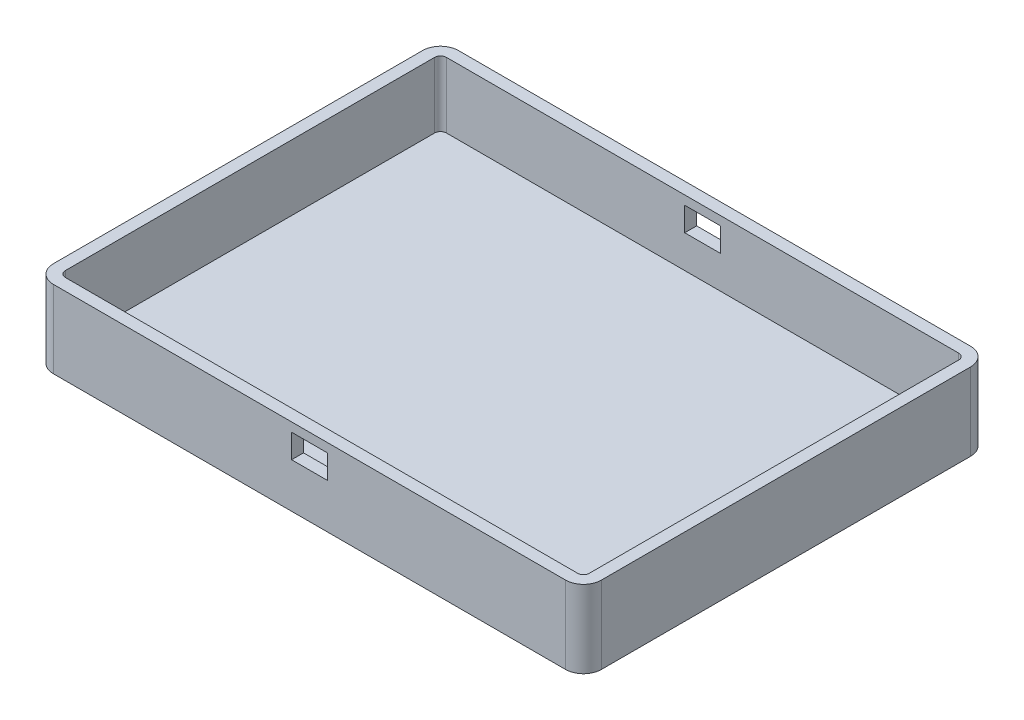
ISO-10303-21;
HEADER;
FILE_DESCRIPTION(('STEP AP214'),'2;1');
FILE_NAME('part.step','',(''),(''),'','','');
FILE_SCHEMA(('AUTOMOTIVE_DESIGN { 1 0 10303 214 1 1 1 1 }'));
ENDSEC;
DATA;
#1=APPLICATION_CONTEXT('core data for automotive mechanical design processes');
#2=APPLICATION_PROTOCOL_DEFINITION('international standard','automotive_design',2000,#1);
#3=PRODUCT_CONTEXT('',#1,'mechanical');
#4=PRODUCT('Part','Part','',(#3));
#5=PRODUCT_RELATED_PRODUCT_CATEGORY('part','',(#4));
#6=PRODUCT_DEFINITION_FORMATION('','',#4);
#7=PRODUCT_DEFINITION_CONTEXT('part definition',#1,'design');
#8=PRODUCT_DEFINITION('design','',#6,#7);
#9=PRODUCT_DEFINITION_SHAPE('','',#8);
#10=(LENGTH_UNIT() NAMED_UNIT(*) SI_UNIT(.MILLI.,.METRE.));
#11=(NAMED_UNIT(*) PLANE_ANGLE_UNIT() SI_UNIT($,.RADIAN.));
#12=(NAMED_UNIT(*) SI_UNIT($,.STERADIAN.) SOLID_ANGLE_UNIT());
#13=UNCERTAINTY_MEASURE_WITH_UNIT(LENGTH_MEASURE(1.E-05),#10,'distance_accuracy_value','');
#14=(GEOMETRIC_REPRESENTATION_CONTEXT(3) GLOBAL_UNCERTAINTY_ASSIGNED_CONTEXT((#13)) GLOBAL_UNIT_ASSIGNED_CONTEXT((#10,
#11,#12)) REPRESENTATION_CONTEXT('',''));
#15=CARTESIAN_POINT('',(0.,0.,0.));
#16=DIRECTION('',(0.,0.,1.));
#17=DIRECTION('',(1.,0.,0.));
#18=AXIS2_PLACEMENT_3D('',#15,#16,#17);
#19=CARTESIAN_POINT('',(46.,13.,-34.));
#20=DIRECTION('',(-1.,0.,0.));
#21=DIRECTION('',(0.,0.,1.));
#22=AXIS2_PLACEMENT_3D('',#19,#20,#21);
#23=PLANE('',#22);
#24=DIRECTION('',(0.,0.,-1.));
#25=VECTOR('',#24,1.);
#26=CARTESIAN_POINT('',(46.,0.,-34.));
#27=LINE('',#26,#25);
#28=CARTESIAN_POINT('',(46.,0.,31.));
#29=VERTEX_POINT('',#28);
#30=CARTESIAN_POINT('',(46.,0.,-31.));
#31=VERTEX_POINT('',#30);
#32=EDGE_CURVE('E292',#29,#31,#27,.T.);
#33=ORIENTED_EDGE('',*,*,#32,.T.);
#34=DIRECTION('',(0.,-1.,0.));
#35=VECTOR('',#34,1.);
#36=CARTESIAN_POINT('',(46.,13.,-31.));
#37=LINE('',#36,#35);
#38=CARTESIAN_POINT('',(46.,13.,-31.));
#39=VERTEX_POINT('',#38);
#40=EDGE_CURVE('E360',#31,#39,#37,.F.);
#41=ORIENTED_EDGE('',*,*,#40,.T.);
#42=DIRECTION('',(0.,0.,-1.));
#43=VECTOR('',#42,1.);
#44=CARTESIAN_POINT('',(46.,13.,-34.));
#45=LINE('',#44,#43);
#46=CARTESIAN_POINT('',(46.,13.,31.));
#47=VERTEX_POINT('',#46);
#48=EDGE_CURVE('E308',#47,#39,#45,.T.);
#49=ORIENTED_EDGE('',*,*,#48,.F.);
#50=DIRECTION('',(0.,-1.,0.));
#51=VECTOR('',#50,1.);
#52=CARTESIAN_POINT('',(46.,13.,31.));
#53=LINE('',#52,#51);
#54=EDGE_CURVE('E357',#47,#29,#53,.T.);
#55=ORIENTED_EDGE('',*,*,#54,.T.);
#56=EDGE_LOOP('',(#33,#41,#49,#55));
#57=FACE_BOUND('',#56,.T.);
#58=ADVANCED_FACE('F32',(#57),#23,.F.);
#59=CARTESIAN_POINT('',(-46.,13.,-34.));
#60=DIRECTION('',(0.,0.,1.));
#61=DIRECTION('',(1.,0.,0.));
#62=AXIS2_PLACEMENT_3D('',#59,#60,#61);
#63=PLANE('',#62);
#64=DIRECTION('',(1.,0.,0.));
#65=VECTOR('',#64,1.);
#66=CARTESIAN_POINT('',(-3.,7.5,-34.));
#67=LINE('',#66,#65);
#68=CARTESIAN_POINT('',(-3.,7.5,-34.));
#69=VERTEX_POINT('',#68);
#70=CARTESIAN_POINT('',(3.,7.5,-34.));
#71=VERTEX_POINT('',#70);
#72=EDGE_CURVE('E215',#69,#71,#67,.T.);
#73=ORIENTED_EDGE('',*,*,#72,.T.);
#74=DIRECTION('',(0.,1.,0.));
#75=VECTOR('',#74,1.);
#76=CARTESIAN_POINT('',(3.,11.5,-34.));
#77=LINE('',#76,#75);
#78=CARTESIAN_POINT('',(3.,11.5,-34.));
#79=VERTEX_POINT('',#78);
#80=EDGE_CURVE('E198',#71,#79,#77,.T.);
#81=ORIENTED_EDGE('',*,*,#80,.T.);
#82=DIRECTION('',(-1.,0.,0.));
#83=VECTOR('',#82,1.);
#84=CARTESIAN_POINT('',(-3.,11.5,-34.));
#85=LINE('',#84,#83);
#86=CARTESIAN_POINT('',(-3.,11.5,-34.));
#87=VERTEX_POINT('',#86);
#88=EDGE_CURVE('E207',#79,#87,#85,.T.);
#89=ORIENTED_EDGE('',*,*,#88,.T.);
#90=DIRECTION('',(0.,-1.,0.));
#91=VECTOR('',#90,1.);
#92=CARTESIAN_POINT('',(-3.,11.5,-34.));
#93=LINE('',#92,#91);
#94=EDGE_CURVE('E47',#87,#69,#93,.T.);
#95=ORIENTED_EDGE('',*,*,#94,.T.);
#96=EDGE_LOOP('',(#73,#81,#89,#95));
#97=FACE_BOUND('',#96,.T.);
#98=DIRECTION('',(-1.,0.,0.));
#99=VECTOR('',#98,1.);
#100=CARTESIAN_POINT('',(-46.,0.,-34.));
#101=LINE('',#100,#99);
#102=CARTESIAN_POINT('',(43.,0.,-34.));
#103=VERTEX_POINT('',#102);
#104=CARTESIAN_POINT('',(-43.,0.,-34.));
#105=VERTEX_POINT('',#104);
#106=EDGE_CURVE('E324',#103,#105,#101,.T.);
#107=ORIENTED_EDGE('',*,*,#106,.T.);
#108=DIRECTION('',(0.,-1.,0.));
#109=VECTOR('',#108,1.);
#110=CARTESIAN_POINT('',(-43.,13.,-34.));
#111=LINE('',#110,#109);
#112=CARTESIAN_POINT('',(-43.,13.,-34.));
#113=VERTEX_POINT('',#112);
#114=EDGE_CURVE('E347',#105,#113,#111,.F.);
#115=ORIENTED_EDGE('',*,*,#114,.T.);
#116=DIRECTION('',(-1.,0.,0.));
#117=VECTOR('',#116,1.);
#118=CARTESIAN_POINT('',(-46.,13.,-34.));
#119=LINE('',#118,#117);
#120=CARTESIAN_POINT('',(43.,13.,-34.));
#121=VERTEX_POINT('',#120);
#122=EDGE_CURVE('E311',#121,#113,#119,.T.);
#123=ORIENTED_EDGE('',*,*,#122,.F.);
#124=DIRECTION('',(0.,-1.,0.));
#125=VECTOR('',#124,1.);
#126=CARTESIAN_POINT('',(43.,13.,-34.));
#127=LINE('',#126,#125);
#128=EDGE_CURVE('E344',#121,#103,#127,.T.);
#129=ORIENTED_EDGE('',*,*,#128,.T.);
#130=EDGE_LOOP('',(#107,#115,#123,#129));
#131=FACE_BOUND('',#130,.T.);
#132=ADVANCED_FACE('F212',(#97,#131),#63,.F.);
#133=CARTESIAN_POINT('',(-46.,13.,-34.));
#134=DIRECTION('',(1.,0.,0.));
#135=DIRECTION('',(0.,0.,-1.));
#136=AXIS2_PLACEMENT_3D('',#133,#134,#135);
#137=PLANE('',#136);
#138=DIRECTION('',(0.,0.,1.));
#139=VECTOR('',#138,1.);
#140=CARTESIAN_POINT('',(-46.,13.,-34.));
#141=LINE('',#140,#139);
#142=CARTESIAN_POINT('',(-46.,13.,-31.));
#143=VERTEX_POINT('',#142);
#144=CARTESIAN_POINT('',(-46.,13.,31.));
#145=VERTEX_POINT('',#144);
#146=EDGE_CURVE('E315',#143,#145,#141,.T.);
#147=ORIENTED_EDGE('',*,*,#146,.F.);
#148=DIRECTION('',(0.,-1.,0.));
#149=VECTOR('',#148,1.);
#150=CARTESIAN_POINT('',(-46.,13.,-31.));
#151=LINE('',#150,#149);
#152=CARTESIAN_POINT('',(-46.,0.,-31.));
#153=VERTEX_POINT('',#152);
#154=EDGE_CURVE('E333',#143,#153,#151,.T.);
#155=ORIENTED_EDGE('',*,*,#154,.T.);
#156=DIRECTION('',(0.,0.,1.));
#157=VECTOR('',#156,1.);
#158=CARTESIAN_POINT('',(-46.,0.,-34.));
#159=LINE('',#158,#157);
#160=CARTESIAN_POINT('',(-46.,0.,31.));
#161=VERTEX_POINT('',#160);
#162=EDGE_CURVE('E327',#153,#161,#159,.T.);
#163=ORIENTED_EDGE('',*,*,#162,.T.);
#164=DIRECTION('',(0.,-1.,0.));
#165=VECTOR('',#164,1.);
#166=CARTESIAN_POINT('',(-46.,13.,31.));
#167=LINE('',#166,#165);
#168=EDGE_CURVE('E321',#161,#145,#167,.F.);
#169=ORIENTED_EDGE('',*,*,#168,.T.);
#170=EDGE_LOOP('',(#147,#155,#163,#169));
#171=FACE_BOUND('',#170,.T.);
#172=ADVANCED_FACE('F395',(#171),#137,.F.);
#173=CARTESIAN_POINT('',(-46.,13.,34.));
#174=DIRECTION('',(0.,0.,-1.));
#175=DIRECTION('',(-1.,0.,0.));
#176=AXIS2_PLACEMENT_3D('',#173,#174,#175);
#177=PLANE('',#176);
#178=DIRECTION('',(1.,0.,0.));
#179=VECTOR('',#178,1.);
#180=CARTESIAN_POINT('',(-46.,11.5,34.));
#181=LINE('',#180,#179);
#182=CARTESIAN_POINT('',(-3.,11.5,34.));
#183=VERTEX_POINT('',#182);
#184=CARTESIAN_POINT('',(3.,11.5,34.));
#185=VERTEX_POINT('',#184);
#186=EDGE_CURVE('E230',#183,#185,#181,.T.);
#187=ORIENTED_EDGE('',*,*,#186,.T.);
#188=DIRECTION('',(0.,-1.,0.));
#189=VECTOR('',#188,1.);
#190=CARTESIAN_POINT('',(3.,13.,34.));
#191=LINE('',#190,#189);
#192=CARTESIAN_POINT('',(3.,7.5,34.));
#193=VERTEX_POINT('',#192);
#194=EDGE_CURVE('E244',#185,#193,#191,.T.);
#195=ORIENTED_EDGE('',*,*,#194,.T.);
#196=DIRECTION('',(-1.,0.,0.));
#197=VECTOR('',#196,1.);
#198=CARTESIAN_POINT('',(-46.,7.5,34.));
#199=LINE('',#198,#197);
#200=CARTESIAN_POINT('',(-3.,7.5,34.));
#201=VERTEX_POINT('',#200);
#202=EDGE_CURVE('E240',#193,#201,#199,.T.);
#203=ORIENTED_EDGE('',*,*,#202,.T.);
#204=DIRECTION('',(0.,1.,0.));
#205=VECTOR('',#204,1.);
#206=CARTESIAN_POINT('',(-3.,13.,34.));
#207=LINE('',#206,#205);
#208=EDGE_CURVE('E235',#201,#183,#207,.T.);
#209=ORIENTED_EDGE('',*,*,#208,.T.);
#210=EDGE_LOOP('',(#187,#195,#203,#209));
#211=FACE_BOUND('',#210,.T.);
#212=DIRECTION('',(1.,0.,0.));
#213=VECTOR('',#212,1.);
#214=CARTESIAN_POINT('',(-46.,0.,34.));
#215=LINE('',#214,#213);
#216=CARTESIAN_POINT('',(-43.,0.,34.));
#217=VERTEX_POINT('',#216);
#218=CARTESIAN_POINT('',(43.,0.,34.));
#219=VERTEX_POINT('',#218);
#220=EDGE_CURVE('E312',#217,#219,#215,.T.);
#221=ORIENTED_EDGE('',*,*,#220,.T.);
#222=DIRECTION('',(0.,-1.,0.));
#223=VECTOR('',#222,1.);
#224=CARTESIAN_POINT('',(43.,13.,34.));
#225=LINE('',#224,#223);
#226=CARTESIAN_POINT('',(43.,13.,34.));
#227=VERTEX_POINT('',#226);
#228=EDGE_CURVE('E365',#219,#227,#225,.F.);
#229=ORIENTED_EDGE('',*,*,#228,.T.);
#230=DIRECTION('',(1.,0.,0.));
#231=VECTOR('',#230,1.);
#232=CARTESIAN_POINT('',(-46.,13.,34.));
#233=LINE('',#232,#231);
#234=CARTESIAN_POINT('',(-43.,13.,34.));
#235=VERTEX_POINT('',#234);
#236=EDGE_CURVE('E318',#235,#227,#233,.T.);
#237=ORIENTED_EDGE('',*,*,#236,.F.);
#238=DIRECTION('',(0.,-1.,0.));
#239=VECTOR('',#238,1.);
#240=CARTESIAN_POINT('',(-43.,13.,34.));
#241=LINE('',#240,#239);
#242=EDGE_CURVE('E362',#235,#217,#241,.T.);
#243=ORIENTED_EDGE('',*,*,#242,.T.);
#244=EDGE_LOOP('',(#221,#229,#237,#243));
#245=FACE_BOUND('',#244,.T.);
#246=ADVANCED_FACE('F391',(#211,#245),#177,.F.);
#247=CARTESIAN_POINT('',(0.,13.,0.));
#248=DIRECTION('',(0.,1.,0.));
#249=DIRECTION('',(0.,0.,1.));
#250=AXIS2_PLACEMENT_3D('',#247,#248,#249);
#251=PLANE('',#250);
#252=DIRECTION('',(-1.,0.,0.));
#253=VECTOR('',#252,1.);
#254=CARTESIAN_POINT('',(-46.,13.,-32.));
#255=LINE('',#254,#253);
#256=CARTESIAN_POINT('',(43.,13.,-32.));
#257=VERTEX_POINT('',#256);
#258=CARTESIAN_POINT('',(-43.,13.,-32.));
#259=VERTEX_POINT('',#258);
#260=EDGE_CURVE('E294',#257,#259,#255,.T.);
#261=ORIENTED_EDGE('',*,*,#260,.F.);
#262=CARTESIAN_POINT('',(43.,13.,-31.));
#263=DIRECTION('',(0.,1.,0.));
#264=DIRECTION('',(0.,0.,1.));
#265=AXIS2_PLACEMENT_3D('',#262,#263,#264);
#266=CIRCLE('',#265,1.);
#267=CARTESIAN_POINT('',(44.,13.,-31.));
#268=VERTEX_POINT('',#267);
#269=EDGE_CURVE('E295',#268,#257,#266,.T.);
#270=ORIENTED_EDGE('',*,*,#269,.F.);
#271=DIRECTION('',(0.,0.,-1.));
#272=VECTOR('',#271,1.);
#273=CARTESIAN_POINT('',(44.,13.,-34.));
#274=LINE('',#273,#272);
#275=CARTESIAN_POINT('',(44.,13.,31.));
#276=VERTEX_POINT('',#275);
#277=EDGE_CURVE('E275',#276,#268,#274,.T.);
#278=ORIENTED_EDGE('',*,*,#277,.F.);
#279=CARTESIAN_POINT('',(43.,13.,31.));
#280=DIRECTION('',(0.,1.,0.));
#281=DIRECTION('',(0.,0.,1.));
#282=AXIS2_PLACEMENT_3D('',#279,#280,#281);
#283=CIRCLE('',#282,1.);
#284=CARTESIAN_POINT('',(43.,13.,32.));
#285=VERTEX_POINT('',#284);
#286=EDGE_CURVE('E297',#285,#276,#283,.T.);
#287=ORIENTED_EDGE('',*,*,#286,.F.);
#288=DIRECTION('',(1.,0.,0.));
#289=VECTOR('',#288,1.);
#290=CARTESIAN_POINT('',(-46.,13.,32.));
#291=LINE('',#290,#289);
#292=CARTESIAN_POINT('',(-43.,13.,32.));
#293=VERTEX_POINT('',#292);
#294=EDGE_CURVE('E287',#293,#285,#291,.T.);
#295=ORIENTED_EDGE('',*,*,#294,.F.);
#296=CARTESIAN_POINT('',(-43.,13.,31.));
#297=DIRECTION('',(0.,1.,0.));
#298=DIRECTION('',(0.,0.,1.));
#299=AXIS2_PLACEMENT_3D('',#296,#297,#298);
#300=CIRCLE('',#299,1.);
#301=CARTESIAN_POINT('',(-44.,13.,31.));
#302=VERTEX_POINT('',#301);
#303=EDGE_CURVE('E280',#302,#293,#300,.T.);
#304=ORIENTED_EDGE('',*,*,#303,.F.);
#305=DIRECTION('',(0.,0.,1.));
#306=VECTOR('',#305,1.);
#307=CARTESIAN_POINT('',(-44.,13.,-34.));
#308=LINE('',#307,#306);
#309=CARTESIAN_POINT('',(-44.,13.,-31.));
#310=VERTEX_POINT('',#309);
#311=EDGE_CURVE('E300',#310,#302,#308,.T.);
#312=ORIENTED_EDGE('',*,*,#311,.F.);
#313=CARTESIAN_POINT('',(-43.,13.,-31.));
#314=DIRECTION('',(0.,1.,0.));
#315=DIRECTION('',(0.,0.,1.));
#316=AXIS2_PLACEMENT_3D('',#313,#314,#315);
#317=CIRCLE('',#316,1.);
#318=EDGE_CURVE('E258',#259,#310,#317,.T.);
#319=ORIENTED_EDGE('',*,*,#318,.F.);
#320=EDGE_LOOP('',(#261,#270,#278,#287,#295,#304,#312,#319));
#321=FACE_BOUND('',#320,.T.);
#322=ORIENTED_EDGE('',*,*,#122,.T.);
#323=CARTESIAN_POINT('',(-43.,13.,-31.));
#324=DIRECTION('',(0.,1.,0.));
#325=DIRECTION('',(0.,0.,1.));
#326=AXIS2_PLACEMENT_3D('',#323,#324,#325);
#327=CIRCLE('',#326,3.);
#328=EDGE_CURVE('E355',#113,#143,#327,.T.);
#329=ORIENTED_EDGE('',*,*,#328,.T.);
#330=ORIENTED_EDGE('',*,*,#146,.T.);
#331=CARTESIAN_POINT('',(-43.,13.,31.));
#332=DIRECTION('',(0.,1.,0.));
#333=DIRECTION('',(0.,0.,1.));
#334=AXIS2_PLACEMENT_3D('',#331,#332,#333);
#335=CIRCLE('',#334,3.);
#336=EDGE_CURVE('E349',#145,#235,#335,.T.);
#337=ORIENTED_EDGE('',*,*,#336,.T.);
#338=ORIENTED_EDGE('',*,*,#236,.T.);
#339=CARTESIAN_POINT('',(43.,13.,31.));
#340=DIRECTION('',(0.,1.,0.));
#341=DIRECTION('',(0.,0.,1.));
#342=AXIS2_PLACEMENT_3D('',#339,#340,#341);
#343=CIRCLE('',#342,3.);
#344=EDGE_CURVE('E351',#227,#47,#343,.T.);
#345=ORIENTED_EDGE('',*,*,#344,.T.);
#346=ORIENTED_EDGE('',*,*,#48,.T.);
#347=CARTESIAN_POINT('',(43.,13.,-31.));
#348=DIRECTION('',(0.,1.,0.));
#349=DIRECTION('',(0.,0.,1.));
#350=AXIS2_PLACEMENT_3D('',#347,#348,#349);
#351=CIRCLE('',#350,3.);
#352=EDGE_CURVE('E353',#39,#121,#351,.T.);
#353=ORIENTED_EDGE('',*,*,#352,.T.);
#354=EDGE_LOOP('',(#322,#329,#330,#337,#338,#345,#346,#353));
#355=FACE_BOUND('',#354,.T.);
#356=ADVANCED_FACE('F394',(#321,#355),#251,.T.);
#357=CARTESIAN_POINT('',(0.,0.,0.));
#358=DIRECTION('',(0.,1.,0.));
#359=DIRECTION('',(0.,0.,1.));
#360=AXIS2_PLACEMENT_3D('',#357,#358,#359);
#361=PLANE('',#360);
#362=ORIENTED_EDGE('',*,*,#162,.F.);
#363=CARTESIAN_POINT('',(-43.,0.,-31.));
#364=DIRECTION('',(0.,1.,0.));
#365=DIRECTION('',(0.,0.,1.));
#366=AXIS2_PLACEMENT_3D('',#363,#364,#365);
#367=CIRCLE('',#366,3.);
#368=EDGE_CURVE('E342',#153,#105,#367,.F.);
#369=ORIENTED_EDGE('',*,*,#368,.T.);
#370=ORIENTED_EDGE('',*,*,#106,.F.);
#371=CARTESIAN_POINT('',(43.,0.,-31.));
#372=DIRECTION('',(0.,1.,0.));
#373=DIRECTION('',(0.,0.,1.));
#374=AXIS2_PLACEMENT_3D('',#371,#372,#373);
#375=CIRCLE('',#374,3.);
#376=EDGE_CURVE('E340',#103,#31,#375,.F.);
#377=ORIENTED_EDGE('',*,*,#376,.T.);
#378=ORIENTED_EDGE('',*,*,#32,.F.);
#379=CARTESIAN_POINT('',(43.,0.,31.));
#380=DIRECTION('',(0.,1.,0.));
#381=DIRECTION('',(0.,0.,1.));
#382=AXIS2_PLACEMENT_3D('',#379,#380,#381);
#383=CIRCLE('',#382,3.);
#384=EDGE_CURVE('E338',#29,#219,#383,.F.);
#385=ORIENTED_EDGE('',*,*,#384,.T.);
#386=ORIENTED_EDGE('',*,*,#220,.F.);
#387=CARTESIAN_POINT('',(-43.,0.,31.));
#388=DIRECTION('',(0.,1.,0.));
#389=DIRECTION('',(0.,0.,1.));
#390=AXIS2_PLACEMENT_3D('',#387,#388,#389);
#391=CIRCLE('',#390,3.);
#392=EDGE_CURVE('E336',#217,#161,#391,.F.);
#393=ORIENTED_EDGE('',*,*,#392,.T.);
#394=EDGE_LOOP('',(#362,#369,#370,#377,#378,#385,#386,#393));
#395=FACE_BOUND('',#394,.T.);
#396=ADVANCED_FACE('F428',(#395),#361,.F.);
#397=CARTESIAN_POINT('',(-43.,13.,-31.));
#398=DIRECTION('',(0.,-1.,0.));
#399=DIRECTION('',(0.,0.,-1.));
#400=AXIS2_PLACEMENT_3D('',#397,#398,#399);
#401=CYLINDRICAL_SURFACE('',#400,3.);
#402=ORIENTED_EDGE('',*,*,#328,.F.);
#403=ORIENTED_EDGE('',*,*,#114,.F.);
#404=ORIENTED_EDGE('',*,*,#368,.F.);
#405=ORIENTED_EDGE('',*,*,#154,.F.);
#406=EDGE_LOOP('',(#402,#403,#404,#405));
#407=FACE_BOUND('',#406,.T.);
#408=ADVANCED_FACE('F420',(#407),#401,.T.);
#409=CARTESIAN_POINT('',(43.,13.,-31.));
#410=DIRECTION('',(0.,-1.,0.));
#411=DIRECTION('',(0.,0.,-1.));
#412=AXIS2_PLACEMENT_3D('',#409,#410,#411);
#413=CYLINDRICAL_SURFACE('',#412,3.);
#414=ORIENTED_EDGE('',*,*,#352,.F.);
#415=ORIENTED_EDGE('',*,*,#40,.F.);
#416=ORIENTED_EDGE('',*,*,#376,.F.);
#417=ORIENTED_EDGE('',*,*,#128,.F.);
#418=EDGE_LOOP('',(#414,#415,#416,#417));
#419=FACE_BOUND('',#418,.T.);
#420=ADVANCED_FACE('F413',(#419),#413,.T.);
#421=CARTESIAN_POINT('',(43.,13.,31.));
#422=DIRECTION('',(0.,-1.,0.));
#423=DIRECTION('',(0.,0.,-1.));
#424=AXIS2_PLACEMENT_3D('',#421,#422,#423);
#425=CYLINDRICAL_SURFACE('',#424,3.);
#426=ORIENTED_EDGE('',*,*,#344,.F.);
#427=ORIENTED_EDGE('',*,*,#228,.F.);
#428=ORIENTED_EDGE('',*,*,#384,.F.);
#429=ORIENTED_EDGE('',*,*,#54,.F.);
#430=EDGE_LOOP('',(#426,#427,#428,#429));
#431=FACE_BOUND('',#430,.T.);
#432=ADVANCED_FACE('F404',(#431),#425,.T.);
#433=CARTESIAN_POINT('',(-43.,13.,31.));
#434=DIRECTION('',(0.,-1.,0.));
#435=DIRECTION('',(0.,0.,-1.));
#436=AXIS2_PLACEMENT_3D('',#433,#434,#435);
#437=CYLINDRICAL_SURFACE('',#436,3.);
#438=ORIENTED_EDGE('',*,*,#336,.F.);
#439=ORIENTED_EDGE('',*,*,#168,.F.);
#440=ORIENTED_EDGE('',*,*,#392,.F.);
#441=ORIENTED_EDGE('',*,*,#242,.F.);
#442=EDGE_LOOP('',(#438,#439,#440,#441));
#443=FACE_BOUND('',#442,.T.);
#444=ADVANCED_FACE('F34',(#443),#437,.T.);
#445=CARTESIAN_POINT('',(44.,13.,-34.));
#446=DIRECTION('',(-1.,0.,0.));
#447=DIRECTION('',(0.,0.,1.));
#448=AXIS2_PLACEMENT_3D('',#445,#446,#447);
#449=PLANE('',#448);
#450=DIRECTION('',(0.,0.,-1.));
#451=VECTOR('',#450,1.);
#452=CARTESIAN_POINT('',(44.,2.,-34.));
#453=LINE('',#452,#451);
#454=CARTESIAN_POINT('',(44.,2.,31.));
#455=VERTEX_POINT('',#454);
#456=CARTESIAN_POINT('',(44.,2.,-31.));
#457=VERTEX_POINT('',#456);
#458=EDGE_CURVE('E247',#455,#457,#453,.T.);
#459=ORIENTED_EDGE('',*,*,#458,.F.);
#460=DIRECTION('',(0.,1.,0.));
#461=VECTOR('',#460,1.);
#462=CARTESIAN_POINT('',(44.,13.,31.));
#463=LINE('',#462,#461);
#464=EDGE_CURVE('E255',#276,#455,#463,.F.);
#465=ORIENTED_EDGE('',*,*,#464,.F.);
#466=ORIENTED_EDGE('',*,*,#277,.T.);
#467=DIRECTION('',(0.,1.,0.));
#468=VECTOR('',#467,1.);
#469=CARTESIAN_POINT('',(44.,13.,-31.));
#470=LINE('',#469,#468);
#471=EDGE_CURVE('E251',#457,#268,#470,.T.);
#472=ORIENTED_EDGE('',*,*,#471,.F.);
#473=EDGE_LOOP('',(#459,#465,#466,#472));
#474=FACE_BOUND('',#473,.T.);
#475=ADVANCED_FACE('F451',(#474),#449,.T.);
#476=CARTESIAN_POINT('',(-46.,13.,-32.));
#477=DIRECTION('',(0.,0.,1.));
#478=DIRECTION('',(1.,0.,0.));
#479=AXIS2_PLACEMENT_3D('',#476,#477,#478);
#480=PLANE('',#479);
#481=DIRECTION('',(0.,1.,0.));
#482=VECTOR('',#481,1.);
#483=CARTESIAN_POINT('',(3.,13.,-32.));
#484=LINE('',#483,#482);
#485=CARTESIAN_POINT('',(3.,7.5,-32.));
#486=VERTEX_POINT('',#485);
#487=CARTESIAN_POINT('',(3.,11.5,-32.));
#488=VERTEX_POINT('',#487);
#489=EDGE_CURVE('E201',#486,#488,#484,.T.);
#490=ORIENTED_EDGE('',*,*,#489,.F.);
#491=DIRECTION('',(1.,0.,0.));
#492=VECTOR('',#491,1.);
#493=CARTESIAN_POINT('',(-46.,7.5,-32.));
#494=LINE('',#493,#492);
#495=CARTESIAN_POINT('',(-3.,7.5,-32.));
#496=VERTEX_POINT('',#495);
#497=EDGE_CURVE('E238',#496,#486,#494,.T.);
#498=ORIENTED_EDGE('',*,*,#497,.F.);
#499=DIRECTION('',(0.,-1.,0.));
#500=VECTOR('',#499,1.);
#501=CARTESIAN_POINT('',(-3.,13.,-32.));
#502=LINE('',#501,#500);
#503=CARTESIAN_POINT('',(-3.,11.5,-32.));
#504=VERTEX_POINT('',#503);
#505=EDGE_CURVE('E233',#504,#496,#502,.T.);
#506=ORIENTED_EDGE('',*,*,#505,.F.);
#507=DIRECTION('',(-1.,0.,0.));
#508=VECTOR('',#507,1.);
#509=CARTESIAN_POINT('',(-46.,11.5,-32.));
#510=LINE('',#509,#508);
#511=EDGE_CURVE('E222',#488,#504,#510,.T.);
#512=ORIENTED_EDGE('',*,*,#511,.F.);
#513=EDGE_LOOP('',(#490,#498,#506,#512));
#514=FACE_BOUND('',#513,.T.);
#515=DIRECTION('',(-1.,0.,0.));
#516=VECTOR('',#515,1.);
#517=CARTESIAN_POINT('',(-46.,2.,-32.));
#518=LINE('',#517,#516);
#519=CARTESIAN_POINT('',(43.,2.,-32.));
#520=VERTEX_POINT('',#519);
#521=CARTESIAN_POINT('',(-43.,2.,-32.));
#522=VERTEX_POINT('',#521);
#523=EDGE_CURVE('E250',#520,#522,#518,.T.);
#524=ORIENTED_EDGE('',*,*,#523,.F.);
#525=DIRECTION('',(0.,1.,0.));
#526=VECTOR('',#525,1.);
#527=CARTESIAN_POINT('',(43.,13.,-32.));
#528=LINE('',#527,#526);
#529=EDGE_CURVE('E265',#257,#520,#528,.F.);
#530=ORIENTED_EDGE('',*,*,#529,.F.);
#531=ORIENTED_EDGE('',*,*,#260,.T.);
#532=DIRECTION('',(0.,1.,0.));
#533=VECTOR('',#532,1.);
#534=CARTESIAN_POINT('',(-43.,13.,-32.));
#535=LINE('',#534,#533);
#536=EDGE_CURVE('E278',#522,#259,#535,.T.);
#537=ORIENTED_EDGE('',*,*,#536,.F.);
#538=EDGE_LOOP('',(#524,#530,#531,#537));
#539=FACE_BOUND('',#538,.T.);
#540=ADVANCED_FACE('F455',(#514,#539),#480,.T.);
#541=CARTESIAN_POINT('',(-44.,13.,-34.));
#542=DIRECTION('',(1.,0.,0.));
#543=DIRECTION('',(0.,0.,-1.));
#544=AXIS2_PLACEMENT_3D('',#541,#542,#543);
#545=PLANE('',#544);
#546=ORIENTED_EDGE('',*,*,#311,.T.);
#547=DIRECTION('',(0.,1.,0.));
#548=VECTOR('',#547,1.);
#549=CARTESIAN_POINT('',(-44.,13.,31.));
#550=LINE('',#549,#548);
#551=CARTESIAN_POINT('',(-44.,2.,31.));
#552=VERTEX_POINT('',#551);
#553=EDGE_CURVE('E285',#552,#302,#550,.T.);
#554=ORIENTED_EDGE('',*,*,#553,.F.);
#555=DIRECTION('',(0.,0.,1.));
#556=VECTOR('',#555,1.);
#557=CARTESIAN_POINT('',(-44.,2.,-34.));
#558=LINE('',#557,#556);
#559=CARTESIAN_POINT('',(-44.,2.,-31.));
#560=VERTEX_POINT('',#559);
#561=EDGE_CURVE('E259',#560,#552,#558,.T.);
#562=ORIENTED_EDGE('',*,*,#561,.F.);
#563=DIRECTION('',(0.,1.,0.));
#564=VECTOR('',#563,1.);
#565=CARTESIAN_POINT('',(-44.,13.,-31.));
#566=LINE('',#565,#564);
#567=EDGE_CURVE('E277',#310,#560,#566,.F.);
#568=ORIENTED_EDGE('',*,*,#567,.F.);
#569=EDGE_LOOP('',(#546,#554,#562,#568));
#570=FACE_BOUND('',#569,.T.);
#571=ADVANCED_FACE('F461',(#570),#545,.T.);
#572=CARTESIAN_POINT('',(-46.,13.,32.));
#573=DIRECTION('',(0.,0.,-1.));
#574=DIRECTION('',(-1.,0.,0.));
#575=AXIS2_PLACEMENT_3D('',#572,#573,#574);
#576=PLANE('',#575);
#577=DIRECTION('',(0.,-1.,0.));
#578=VECTOR('',#577,1.);
#579=CARTESIAN_POINT('',(3.,13.,32.));
#580=LINE('',#579,#578);
#581=CARTESIAN_POINT('',(3.,11.5,32.));
#582=VERTEX_POINT('',#581);
#583=CARTESIAN_POINT('',(3.,7.5,32.));
#584=VERTEX_POINT('',#583);
#585=EDGE_CURVE('E11',#582,#584,#580,.T.);
#586=ORIENTED_EDGE('',*,*,#585,.F.);
#587=DIRECTION('',(1.,0.,0.));
#588=VECTOR('',#587,1.);
#589=CARTESIAN_POINT('',(-46.,11.5,32.));
#590=LINE('',#589,#588);
#591=CARTESIAN_POINT('',(-3.,11.5,32.));
#592=VERTEX_POINT('',#591);
#593=EDGE_CURVE('E367',#592,#582,#590,.T.);
#594=ORIENTED_EDGE('',*,*,#593,.F.);
#595=DIRECTION('',(0.,1.,0.));
#596=VECTOR('',#595,1.);
#597=CARTESIAN_POINT('',(-3.,13.,32.));
#598=LINE('',#597,#596);
#599=CARTESIAN_POINT('',(-3.,7.5,32.));
#600=VERTEX_POINT('',#599);
#601=EDGE_CURVE('E369',#600,#592,#598,.T.);
#602=ORIENTED_EDGE('',*,*,#601,.F.);
#603=DIRECTION('',(-1.,0.,0.));
#604=VECTOR('',#603,1.);
#605=CARTESIAN_POINT('',(-46.,7.5,32.));
#606=LINE('',#605,#604);
#607=EDGE_CURVE('E40',#584,#600,#606,.T.);
#608=ORIENTED_EDGE('',*,*,#607,.F.);
#609=EDGE_LOOP('',(#586,#594,#602,#608));
#610=FACE_BOUND('',#609,.T.);
#611=DIRECTION('',(1.,0.,0.));
#612=VECTOR('',#611,1.);
#613=CARTESIAN_POINT('',(-46.,2.,32.));
#614=LINE('',#613,#612);
#615=CARTESIAN_POINT('',(-43.,2.,32.));
#616=VERTEX_POINT('',#615);
#617=CARTESIAN_POINT('',(43.,2.,32.));
#618=VERTEX_POINT('',#617);
#619=EDGE_CURVE('E262',#616,#618,#614,.T.);
#620=ORIENTED_EDGE('',*,*,#619,.F.);
#621=DIRECTION('',(0.,1.,0.));
#622=VECTOR('',#621,1.);
#623=CARTESIAN_POINT('',(-43.,13.,32.));
#624=LINE('',#623,#622);
#625=EDGE_CURVE('E254',#293,#616,#624,.F.);
#626=ORIENTED_EDGE('',*,*,#625,.F.);
#627=ORIENTED_EDGE('',*,*,#294,.T.);
#628=DIRECTION('',(0.,1.,0.));
#629=VECTOR('',#628,1.);
#630=CARTESIAN_POINT('',(43.,13.,32.));
#631=LINE('',#630,#629);
#632=EDGE_CURVE('E290',#618,#285,#631,.T.);
#633=ORIENTED_EDGE('',*,*,#632,.F.);
#634=EDGE_LOOP('',(#620,#626,#627,#633));
#635=FACE_BOUND('',#634,.T.);
#636=ADVANCED_FACE('F385',(#610,#635),#576,.T.);
#637=CARTESIAN_POINT('',(0.,2.,0.));
#638=DIRECTION('',(0.,1.,0.));
#639=DIRECTION('',(0.,0.,1.));
#640=AXIS2_PLACEMENT_3D('',#637,#638,#639);
#641=PLANE('',#640);
#642=ORIENTED_EDGE('',*,*,#561,.T.);
#643=CARTESIAN_POINT('',(-43.,2.,31.));
#644=DIRECTION('',(0.,1.,0.));
#645=DIRECTION('',(0.,0.,1.));
#646=AXIS2_PLACEMENT_3D('',#643,#644,#645);
#647=CIRCLE('',#646,1.);
#648=EDGE_CURVE('E272',#616,#552,#647,.F.);
#649=ORIENTED_EDGE('',*,*,#648,.F.);
#650=ORIENTED_EDGE('',*,*,#619,.T.);
#651=CARTESIAN_POINT('',(43.,2.,31.));
#652=DIRECTION('',(0.,1.,0.));
#653=DIRECTION('',(0.,0.,1.));
#654=AXIS2_PLACEMENT_3D('',#651,#652,#653);
#655=CIRCLE('',#654,1.);
#656=EDGE_CURVE('E270',#455,#618,#655,.F.);
#657=ORIENTED_EDGE('',*,*,#656,.F.);
#658=ORIENTED_EDGE('',*,*,#458,.T.);
#659=CARTESIAN_POINT('',(43.,2.,-31.));
#660=DIRECTION('',(0.,1.,0.));
#661=DIRECTION('',(0.,0.,1.));
#662=AXIS2_PLACEMENT_3D('',#659,#660,#661);
#663=CIRCLE('',#662,1.);
#664=EDGE_CURVE('E266',#520,#457,#663,.F.);
#665=ORIENTED_EDGE('',*,*,#664,.F.);
#666=ORIENTED_EDGE('',*,*,#523,.T.);
#667=CARTESIAN_POINT('',(-43.,2.,-31.));
#668=DIRECTION('',(0.,1.,0.));
#669=DIRECTION('',(0.,0.,1.));
#670=AXIS2_PLACEMENT_3D('',#667,#668,#669);
#671=CIRCLE('',#670,1.);
#672=EDGE_CURVE('E263',#560,#522,#671,.F.);
#673=ORIENTED_EDGE('',*,*,#672,.F.);
#674=EDGE_LOOP('',(#642,#649,#650,#657,#658,#665,#666,#673));
#675=FACE_BOUND('',#674,.T.);
#676=ADVANCED_FACE('F473',(#675),#641,.T.);
#677=CARTESIAN_POINT('',(-43.,13.,-31.));
#678=DIRECTION('',(0.,-1.,0.));
#679=DIRECTION('',(0.,0.,-1.));
#680=AXIS2_PLACEMENT_3D('',#677,#678,#679);
#681=CYLINDRICAL_SURFACE('',#680,1.);
#682=ORIENTED_EDGE('',*,*,#318,.T.);
#683=ORIENTED_EDGE('',*,*,#567,.T.);
#684=ORIENTED_EDGE('',*,*,#672,.T.);
#685=ORIENTED_EDGE('',*,*,#536,.T.);
#686=EDGE_LOOP('',(#682,#683,#684,#685));
#687=FACE_BOUND('',#686,.T.);
#688=ADVANCED_FACE('F476',(#687),#681,.F.);
#689=CARTESIAN_POINT('',(43.,13.,-31.));
#690=DIRECTION('',(0.,-1.,0.));
#691=DIRECTION('',(0.,0.,-1.));
#692=AXIS2_PLACEMENT_3D('',#689,#690,#691);
#693=CYLINDRICAL_SURFACE('',#692,1.);
#694=ORIENTED_EDGE('',*,*,#269,.T.);
#695=ORIENTED_EDGE('',*,*,#529,.T.);
#696=ORIENTED_EDGE('',*,*,#664,.T.);
#697=ORIENTED_EDGE('',*,*,#471,.T.);
#698=EDGE_LOOP('',(#694,#695,#696,#697));
#699=FACE_BOUND('',#698,.T.);
#700=ADVANCED_FACE('F480',(#699),#693,.F.);
#701=CARTESIAN_POINT('',(43.,13.,31.));
#702=DIRECTION('',(0.,-1.,0.));
#703=DIRECTION('',(0.,0.,-1.));
#704=AXIS2_PLACEMENT_3D('',#701,#702,#703);
#705=CYLINDRICAL_SURFACE('',#704,1.);
#706=ORIENTED_EDGE('',*,*,#286,.T.);
#707=ORIENTED_EDGE('',*,*,#464,.T.);
#708=ORIENTED_EDGE('',*,*,#656,.T.);
#709=ORIENTED_EDGE('',*,*,#632,.T.);
#710=EDGE_LOOP('',(#706,#707,#708,#709));
#711=FACE_BOUND('',#710,.T.);
#712=ADVANCED_FACE('F484',(#711),#705,.F.);
#713=CARTESIAN_POINT('',(-43.,13.,31.));
#714=DIRECTION('',(0.,-1.,0.));
#715=DIRECTION('',(0.,0.,-1.));
#716=AXIS2_PLACEMENT_3D('',#713,#714,#715);
#717=CYLINDRICAL_SURFACE('',#716,1.);
#718=ORIENTED_EDGE('',*,*,#303,.T.);
#719=ORIENTED_EDGE('',*,*,#625,.T.);
#720=ORIENTED_EDGE('',*,*,#648,.T.);
#721=ORIENTED_EDGE('',*,*,#553,.T.);
#722=EDGE_LOOP('',(#718,#719,#720,#721));
#723=FACE_BOUND('',#722,.T.);
#724=ADVANCED_FACE('F488',(#723),#717,.F.);
#725=CARTESIAN_POINT('',(-3.,11.5,-34.));
#726=DIRECTION('',(0.,1.,0.));
#727=DIRECTION('',(0.,0.,1.));
#728=AXIS2_PLACEMENT_3D('',#725,#726,#727);
#729=PLANE('',#728);
#730=DIRECTION('',(0.,0.,1.));
#731=VECTOR('',#730,1.);
#732=CARTESIAN_POINT('',(-3.,11.5,-34.));
#733=LINE('',#732,#731);
#734=EDGE_CURVE('E204',#592,#183,#733,.T.);
#735=ORIENTED_EDGE('',*,*,#734,.F.);
#736=ORIENTED_EDGE('',*,*,#593,.T.);
#737=DIRECTION('',(0.,0.,1.));
#738=VECTOR('',#737,1.);
#739=CARTESIAN_POINT('',(3.,11.5,-34.));
#740=LINE('',#739,#738);
#741=EDGE_CURVE('E55',#582,#185,#740,.T.);
#742=ORIENTED_EDGE('',*,*,#741,.T.);
#743=ORIENTED_EDGE('',*,*,#186,.F.);
#744=EDGE_LOOP('',(#735,#736,#742,#743));
#745=FACE_BOUND('',#744,.T.);
#746=ADVANCED_FACE('F387',(#745),#729,.F.);
#747=CARTESIAN_POINT('',(-3.,11.5,-34.));
#748=DIRECTION('',(-1.,0.,0.));
#749=DIRECTION('',(0.,-1.,0.));
#750=AXIS2_PLACEMENT_3D('',#747,#748,#749);
#751=PLANE('',#750);
#752=DIRECTION('',(0.,0.,1.));
#753=VECTOR('',#752,1.);
#754=CARTESIAN_POINT('',(-3.,7.5,-34.));
#755=LINE('',#754,#753);
#756=EDGE_CURVE('E227',#600,#201,#755,.T.);
#757=ORIENTED_EDGE('',*,*,#756,.F.);
#758=ORIENTED_EDGE('',*,*,#601,.T.);
#759=ORIENTED_EDGE('',*,*,#734,.T.);
#760=ORIENTED_EDGE('',*,*,#208,.F.);
#761=EDGE_LOOP('',(#757,#758,#759,#760));
#762=FACE_BOUND('',#761,.T.);
#763=ADVANCED_FACE('F382',(#762),#751,.F.);
#764=CARTESIAN_POINT('',(-3.,7.5,-34.));
#765=DIRECTION('',(0.,-1.,0.));
#766=DIRECTION('',(0.,0.,-1.));
#767=AXIS2_PLACEMENT_3D('',#764,#765,#766);
#768=PLANE('',#767);
#769=DIRECTION('',(0.,0.,1.));
#770=VECTOR('',#769,1.);
#771=CARTESIAN_POINT('',(3.,7.5,-34.));
#772=LINE('',#771,#770);
#773=EDGE_CURVE('E223',#584,#193,#772,.T.);
#774=ORIENTED_EDGE('',*,*,#773,.F.);
#775=ORIENTED_EDGE('',*,*,#607,.T.);
#776=ORIENTED_EDGE('',*,*,#756,.T.);
#777=ORIENTED_EDGE('',*,*,#202,.F.);
#778=EDGE_LOOP('',(#774,#775,#776,#777));
#779=FACE_BOUND('',#778,.T.);
#780=ADVANCED_FACE('F376',(#779),#768,.F.);
#781=CARTESIAN_POINT('',(3.,11.5,-34.));
#782=DIRECTION('',(1.,0.,0.));
#783=DIRECTION('',(0.,1.,0.));
#784=AXIS2_PLACEMENT_3D('',#781,#782,#783);
#785=PLANE('',#784);
#786=ORIENTED_EDGE('',*,*,#741,.F.);
#787=ORIENTED_EDGE('',*,*,#585,.T.);
#788=ORIENTED_EDGE('',*,*,#773,.T.);
#789=ORIENTED_EDGE('',*,*,#194,.F.);
#790=EDGE_LOOP('',(#786,#787,#788,#789));
#791=FACE_BOUND('',#790,.T.);
#792=ADVANCED_FACE('F389',(#791),#785,.F.);
#793=ORIENTED_EDGE('',*,*,#489,.T.);
#794=EDGE_CURVE('E193',#79,#488,#740,.T.);
#795=ORIENTED_EDGE('',*,*,#794,.F.);
#796=ORIENTED_EDGE('',*,*,#80,.F.);
#797=EDGE_CURVE('E220',#71,#486,#772,.T.);
#798=ORIENTED_EDGE('',*,*,#797,.T.);
#799=EDGE_LOOP('',(#793,#795,#796,#798));
#800=FACE_BOUND('',#799,.T.);
#801=ADVANCED_FACE('F195',(#800),#785,.F.);
#802=ORIENTED_EDGE('',*,*,#497,.T.);
#803=ORIENTED_EDGE('',*,*,#797,.F.);
#804=ORIENTED_EDGE('',*,*,#72,.F.);
#805=EDGE_CURVE('E224',#69,#496,#755,.T.);
#806=ORIENTED_EDGE('',*,*,#805,.T.);
#807=EDGE_LOOP('',(#802,#803,#804,#806));
#808=FACE_BOUND('',#807,.T.);
#809=ADVANCED_FACE('F524',(#808),#768,.F.);
#810=ORIENTED_EDGE('',*,*,#505,.T.);
#811=ORIENTED_EDGE('',*,*,#805,.F.);
#812=ORIENTED_EDGE('',*,*,#94,.F.);
#813=EDGE_CURVE('E209',#87,#504,#733,.T.);
#814=ORIENTED_EDGE('',*,*,#813,.T.);
#815=EDGE_LOOP('',(#810,#811,#812,#814));
#816=FACE_BOUND('',#815,.T.);
#817=ADVANCED_FACE('F519',(#816),#751,.F.);
#818=ORIENTED_EDGE('',*,*,#511,.T.);
#819=ORIENTED_EDGE('',*,*,#813,.F.);
#820=ORIENTED_EDGE('',*,*,#88,.F.);
#821=ORIENTED_EDGE('',*,*,#794,.T.);
#822=EDGE_LOOP('',(#818,#819,#820,#821));
#823=FACE_BOUND('',#822,.T.);
#824=ADVANCED_FACE('F208',(#823),#729,.F.);
#825=CLOSED_SHELL('',(#58,#132,#172,#246,#356,#396,#408,#420,#432,#444,#475,#540,#571,#636,#676,
#688,#700,#712,#724,#746,#763,#780,#792,#801,#809,#817,#824));
#826=MANIFOLD_SOLID_BREP('B2',#825);
#827=ADVANCED_BREP_SHAPE_REPRESENTATION('',(#18,#826),#14);
#828=SHAPE_DEFINITION_REPRESENTATION(#9,#827);
ENDSEC;
END-ISO-10303-21;
